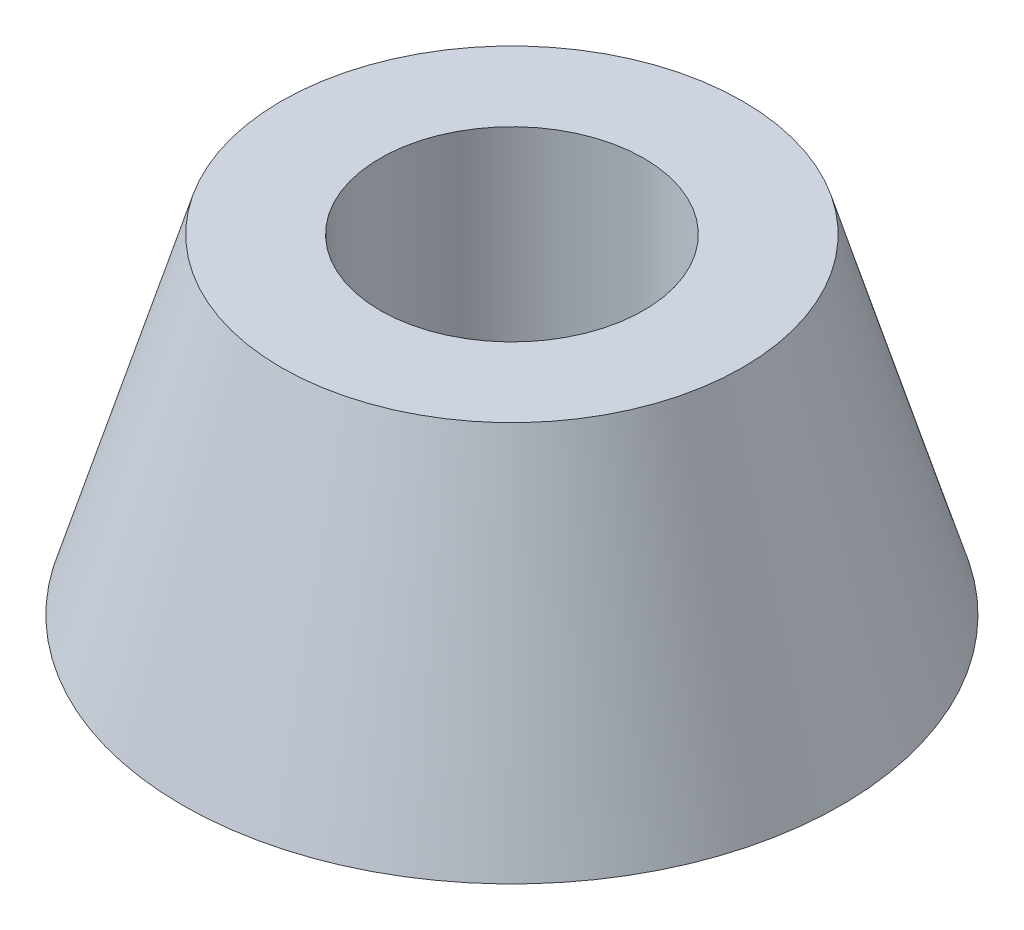
ISO-10303-21;
HEADER;
FILE_DESCRIPTION(('STEP AP214'),'2;1');
FILE_NAME('part.step','',(''),(''),'','','');
FILE_SCHEMA(('AUTOMOTIVE_DESIGN { 1 0 10303 214 1 1 1 1 }'));
ENDSEC;
DATA;
#1=APPLICATION_CONTEXT('core data for automotive mechanical design processes');
#2=APPLICATION_PROTOCOL_DEFINITION('international standard','automotive_design',2000,#1);
#3=PRODUCT_CONTEXT('',#1,'mechanical');
#4=PRODUCT('Part','Part','',(#3));
#5=PRODUCT_RELATED_PRODUCT_CATEGORY('part','',(#4));
#6=PRODUCT_DEFINITION_FORMATION('','',#4);
#7=PRODUCT_DEFINITION_CONTEXT('part definition',#1,'design');
#8=PRODUCT_DEFINITION('design','',#6,#7);
#9=PRODUCT_DEFINITION_SHAPE('','',#8);
#10=(LENGTH_UNIT() NAMED_UNIT(*) SI_UNIT(.MILLI.,.METRE.));
#11=(NAMED_UNIT(*) PLANE_ANGLE_UNIT() SI_UNIT($,.RADIAN.));
#12=(NAMED_UNIT(*) SI_UNIT($,.STERADIAN.) SOLID_ANGLE_UNIT());
#13=UNCERTAINTY_MEASURE_WITH_UNIT(LENGTH_MEASURE(1.E-05),#10,'distance_accuracy_value','');
#14=(GEOMETRIC_REPRESENTATION_CONTEXT(3) GLOBAL_UNCERTAINTY_ASSIGNED_CONTEXT((#13)) GLOBAL_UNIT_ASSIGNED_CONTEXT((#10,
#11,#12)) REPRESENTATION_CONTEXT('',''));
#15=CARTESIAN_POINT('',(0.,0.,0.));
#16=DIRECTION('',(0.,0.,1.));
#17=DIRECTION('',(1.,0.,0.));
#18=AXIS2_PLACEMENT_3D('',#15,#16,#17);
#19=CARTESIAN_POINT('',(0.,0.,0.));
#20=DIRECTION('',(0.,-1.,0.));
#21=DIRECTION('',(0.,0.,1.));
#22=AXIS2_PLACEMENT_3D('',#19,#20,#21);
#23=CONICAL_SURFACE('',#22,10.,0.291456794408166);
#24=CARTESIAN_POINT('',(0.,10.,0.));
#25=DIRECTION('',(0.,1.,0.));
#26=DIRECTION('',(0.,0.,1.));
#27=AXIS2_PLACEMENT_3D('',#24,#25,#26);
#28=CIRCLE('',#27,7.00000000075974);
#29=CARTESIAN_POINT('',(0.,10.,7.00000000075974));
#30=VERTEX_POINT('',#29);
#31=EDGE_CURVE('E10',#30,#30,#28,.T.);
#32=ORIENTED_EDGE('',*,*,#31,.F.);
#33=EDGE_LOOP('',(#32));
#34=FACE_BOUND('',#33,.T.);
#35=CARTESIAN_POINT('',(0.,0.,0.));
#36=DIRECTION('',(0.,1.,0.));
#37=DIRECTION('',(0.,0.,1.));
#38=AXIS2_PLACEMENT_3D('',#35,#36,#37);
#39=CIRCLE('',#38,10.);
#40=CARTESIAN_POINT('',(0.,0.,10.));
#41=VERTEX_POINT('',#40);
#42=EDGE_CURVE('E46',#41,#41,#39,.T.);
#43=ORIENTED_EDGE('',*,*,#42,.T.);
#44=EDGE_LOOP('',(#43));
#45=FACE_BOUND('',#44,.T.);
#46=ADVANCED_FACE('F39',(#34,#45),#23,.T.);
#47=CARTESIAN_POINT('',(0.,10.,0.));
#48=DIRECTION('',(0.,1.,0.));
#49=DIRECTION('',(0.,0.,1.));
#50=AXIS2_PLACEMENT_3D('',#47,#48,#49);
#51=PLANE('',#50);
#52=CARTESIAN_POINT('',(0.,10.,0.));
#53=DIRECTION('',(0.,1.,0.));
#54=DIRECTION('',(0.,0.,1.));
#55=AXIS2_PLACEMENT_3D('',#52,#53,#54);
#56=CIRCLE('',#55,4.);
#57=CARTESIAN_POINT('',(0.,10.,4.));
#58=VERTEX_POINT('',#57);
#59=EDGE_CURVE('E56',#58,#58,#56,.T.);
#60=ORIENTED_EDGE('',*,*,#59,.F.);
#61=EDGE_LOOP('',(#60));
#62=FACE_BOUND('',#61,.T.);
#63=ORIENTED_EDGE('',*,*,#31,.T.);
#64=EDGE_LOOP('',(#63));
#65=FACE_BOUND('',#64,.T.);
#66=ADVANCED_FACE('F92',(#62,#65),#51,.T.);
#67=CARTESIAN_POINT('',(0.,0.,0.));
#68=DIRECTION('',(0.,1.,0.));
#69=DIRECTION('',(0.,0.,1.));
#70=AXIS2_PLACEMENT_3D('',#67,#68,#69);
#71=PLANE('',#70);
#72=CARTESIAN_POINT('',(0.,0.,0.));
#73=DIRECTION('',(0.,1.,0.));
#74=DIRECTION('',(0.,0.,1.));
#75=AXIS2_PLACEMENT_3D('',#72,#73,#74);
#76=CIRCLE('',#75,2.5);
#77=CARTESIAN_POINT('',(0.,0.,2.5));
#78=VERTEX_POINT('',#77);
#79=EDGE_CURVE('E61',#78,#78,#76,.T.);
#80=ORIENTED_EDGE('',*,*,#79,.T.);
#81=EDGE_LOOP('',(#80));
#82=FACE_BOUND('',#81,.T.);
#83=ORIENTED_EDGE('',*,*,#42,.F.);
#84=EDGE_LOOP('',(#83));
#85=FACE_BOUND('',#84,.T.);
#86=ADVANCED_FACE('F71',(#82,#85),#71,.F.);
#87=CARTESIAN_POINT('',(0.,3.,0.));
#88=DIRECTION('',(0.,1.,0.));
#89=DIRECTION('',(0.,0.,1.));
#90=AXIS2_PLACEMENT_3D('',#87,#88,#89);
#91=CYLINDRICAL_SURFACE('',#90,4.);
#92=CARTESIAN_POINT('',(0.,3.,0.));
#93=DIRECTION('',(0.,1.,0.));
#94=DIRECTION('',(0.,0.,1.));
#95=AXIS2_PLACEMENT_3D('',#92,#93,#94);
#96=CIRCLE('',#95,4.);
#97=CARTESIAN_POINT('',(0.,3.,4.));
#98=VERTEX_POINT('',#97);
#99=EDGE_CURVE('E51',#98,#98,#96,.T.);
#100=ORIENTED_EDGE('',*,*,#99,.F.);
#101=EDGE_LOOP('',(#100));
#102=FACE_BOUND('',#101,.T.);
#103=ORIENTED_EDGE('',*,*,#59,.T.);
#104=EDGE_LOOP('',(#103));
#105=FACE_BOUND('',#104,.T.);
#106=ADVANCED_FACE('F83',(#102,#105),#91,.F.);
#107=CARTESIAN_POINT('',(0.,3.,0.));
#108=DIRECTION('',(0.,1.,0.));
#109=DIRECTION('',(0.,0.,1.));
#110=AXIS2_PLACEMENT_3D('',#107,#108,#109);
#111=PLANE('',#110);
#112=CARTESIAN_POINT('',(0.,3.,0.));
#113=DIRECTION('',(0.,1.,0.));
#114=DIRECTION('',(0.,0.,1.));
#115=AXIS2_PLACEMENT_3D('',#112,#113,#114);
#116=CIRCLE('',#115,2.5);
#117=CARTESIAN_POINT('',(0.,3.,2.5));
#118=VERTEX_POINT('',#117);
#119=EDGE_CURVE('E63',#118,#118,#116,.T.);
#120=ORIENTED_EDGE('',*,*,#119,.F.);
#121=EDGE_LOOP('',(#120));
#122=FACE_BOUND('',#121,.T.);
#123=ORIENTED_EDGE('',*,*,#99,.T.);
#124=EDGE_LOOP('',(#123));
#125=FACE_BOUND('',#124,.T.);
#126=ADVANCED_FACE('F77',(#122,#125),#111,.T.);
#127=CARTESIAN_POINT('',(0.,0.,0.));
#128=DIRECTION('',(0.,1.,0.));
#129=DIRECTION('',(0.,0.,1.));
#130=AXIS2_PLACEMENT_3D('',#127,#128,#129);
#131=CYLINDRICAL_SURFACE('',#130,2.5);
#132=ORIENTED_EDGE('',*,*,#79,.F.);
#133=EDGE_LOOP('',(#132));
#134=FACE_BOUND('',#133,.T.);
#135=ORIENTED_EDGE('',*,*,#119,.T.);
#136=EDGE_LOOP('',(#135));
#137=FACE_BOUND('',#136,.T.);
#138=ADVANCED_FACE('F74',(#134,#137),#131,.F.);
#139=CLOSED_SHELL('',(#46,#66,#86,#106,#126,#138));
#140=MANIFOLD_SOLID_BREP('B2',#139);
#141=ADVANCED_BREP_SHAPE_REPRESENTATION('',(#18,#140),#14);
#142=SHAPE_DEFINITION_REPRESENTATION(#9,#141);
ENDSEC;
END-ISO-10303-21;
